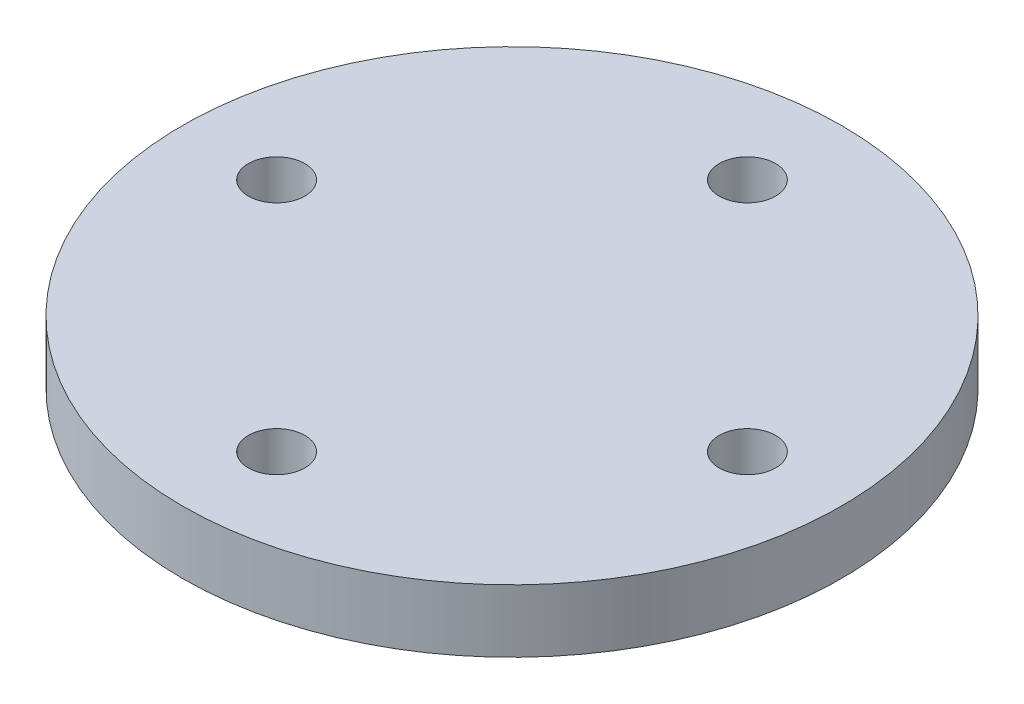
ISO-10303-21;
HEADER;
FILE_DESCRIPTION(('STEP AP214'),'2;1');
FILE_NAME('part.step','',(''),(''),'','','');
FILE_SCHEMA(('AUTOMOTIVE_DESIGN { 1 0 10303 214 1 1 1 1 }'));
ENDSEC;
DATA;
#1=APPLICATION_CONTEXT('core data for automotive mechanical design processes');
#2=APPLICATION_PROTOCOL_DEFINITION('international standard','automotive_design',2000,#1);
#3=PRODUCT_CONTEXT('',#1,'mechanical');
#4=PRODUCT('Part','Part','',(#3));
#5=PRODUCT_RELATED_PRODUCT_CATEGORY('part','',(#4));
#6=PRODUCT_DEFINITION_FORMATION('','',#4);
#7=PRODUCT_DEFINITION_CONTEXT('part definition',#1,'design');
#8=PRODUCT_DEFINITION('design','',#6,#7);
#9=PRODUCT_DEFINITION_SHAPE('','',#8);
#10=(LENGTH_UNIT() NAMED_UNIT(*) SI_UNIT(.MILLI.,.METRE.));
#11=(NAMED_UNIT(*) PLANE_ANGLE_UNIT() SI_UNIT($,.RADIAN.));
#12=(NAMED_UNIT(*) SI_UNIT($,.STERADIAN.) SOLID_ANGLE_UNIT());
#13=UNCERTAINTY_MEASURE_WITH_UNIT(LENGTH_MEASURE(1.E-05),#10,'distance_accuracy_value','');
#14=(GEOMETRIC_REPRESENTATION_CONTEXT(3) GLOBAL_UNCERTAINTY_ASSIGNED_CONTEXT((#13)) GLOBAL_UNIT_ASSIGNED_CONTEXT((#10,
#11,#12)) REPRESENTATION_CONTEXT('',''));
#15=CARTESIAN_POINT('',(0.,0.,0.));
#16=DIRECTION('',(0.,0.,1.));
#17=DIRECTION('',(1.,0.,0.));
#18=AXIS2_PLACEMENT_3D('',#15,#16,#17);
#19=CARTESIAN_POINT('',(0.,2.,0.));
#20=DIRECTION('',(0.,1.,0.));
#21=DIRECTION('',(0.,0.,1.));
#22=AXIS2_PLACEMENT_3D('',#19,#20,#21);
#23=PLANE('',#22);
#24=CARTESIAN_POINT('',(-7.49999999995994,2.,-3.46673283120276E-05));
#25=DIRECTION('',(0.,1.,0.));
#26=DIRECTION('',(0.,0.,1.));
#27=AXIS2_PLACEMENT_3D('',#24,#25,#26);
#28=CIRCLE('',#27,0.899999999999999);
#29=CARTESIAN_POINT('',(-7.49999999995994,2.,0.899965332671687));
#30=VERTEX_POINT('',#29);
#31=EDGE_CURVE('E63',#30,#30,#28,.T.);
#32=ORIENTED_EDGE('',*,*,#31,.F.);
#33=EDGE_LOOP('',(#32));
#34=FACE_BOUND('',#33,.T.);
#35=CARTESIAN_POINT('',(0.,2.,7.5));
#36=DIRECTION('',(0.,1.,0.));
#37=DIRECTION('',(0.,0.,1.));
#38=AXIS2_PLACEMENT_3D('',#35,#36,#37);
#39=CIRCLE('',#38,0.9);
#40=CARTESIAN_POINT('',(0.,2.,8.4));
#41=VERTEX_POINT('',#40);
#42=EDGE_CURVE('E52',#41,#41,#39,.T.);
#43=ORIENTED_EDGE('',*,*,#42,.F.);
#44=EDGE_LOOP('',(#43));
#45=FACE_BOUND('',#44,.T.);
#46=CARTESIAN_POINT('',(0.,2.,0.));
#47=DIRECTION('',(0.,1.,0.));
#48=DIRECTION('',(0.,0.,1.));
#49=AXIS2_PLACEMENT_3D('',#46,#47,#48);
#50=CIRCLE('',#49,10.5);
#51=CARTESIAN_POINT('',(0.,2.,10.5));
#52=VERTEX_POINT('',#51);
#53=EDGE_CURVE('E10',#52,#52,#50,.T.);
#54=ORIENTED_EDGE('',*,*,#53,.T.);
#55=EDGE_LOOP('',(#54));
#56=FACE_BOUND('',#55,.T.);
#57=CARTESIAN_POINT('',(0.,2.,-7.5));
#58=DIRECTION('',(0.,1.,0.));
#59=DIRECTION('',(0.,0.,-1.));
#60=AXIS2_PLACEMENT_3D('',#57,#58,#59);
#61=CIRCLE('',#60,0.9);
#62=CARTESIAN_POINT('',(0.,2.,-8.4));
#63=VERTEX_POINT('',#62);
#64=EDGE_CURVE('E57',#63,#63,#61,.T.);
#65=ORIENTED_EDGE('',*,*,#64,.F.);
#66=EDGE_LOOP('',(#65));
#67=FACE_BOUND('',#66,.T.);
#68=CARTESIAN_POINT('',(7.5,2.,0.));
#69=DIRECTION('',(0.,1.,0.));
#70=DIRECTION('',(0.,0.,-1.));
#71=AXIS2_PLACEMENT_3D('',#68,#69,#70);
#72=CIRCLE('',#71,0.9);
#73=CARTESIAN_POINT('',(7.5,2.,-0.899999999999974));
#74=VERTEX_POINT('',#73);
#75=EDGE_CURVE('E69',#74,#74,#72,.T.);
#76=ORIENTED_EDGE('',*,*,#75,.F.);
#77=EDGE_LOOP('',(#76));
#78=FACE_BOUND('',#77,.T.);
#79=ADVANCED_FACE('F41',(#34,#45,#56,#67,#78),#23,.T.);
#80=CARTESIAN_POINT('',(0.,0.,0.));
#81=DIRECTION('',(0.,1.,0.));
#82=DIRECTION('',(0.,0.,1.));
#83=AXIS2_PLACEMENT_3D('',#80,#81,#82);
#84=PLANE('',#83);
#85=CARTESIAN_POINT('',(0.,0.,0.));
#86=DIRECTION('',(0.,1.,0.));
#87=DIRECTION('',(0.,0.,1.));
#88=AXIS2_PLACEMENT_3D('',#85,#86,#87);
#89=CIRCLE('',#88,10.5);
#90=CARTESIAN_POINT('',(0.,0.,10.5));
#91=VERTEX_POINT('',#90);
#92=EDGE_CURVE('E45',#91,#91,#89,.T.);
#93=ORIENTED_EDGE('',*,*,#92,.F.);
#94=EDGE_LOOP('',(#93));
#95=FACE_BOUND('',#94,.T.);
#96=CARTESIAN_POINT('',(0.,0.,7.5));
#97=DIRECTION('',(0.,1.,0.));
#98=DIRECTION('',(0.,0.,1.));
#99=AXIS2_PLACEMENT_3D('',#96,#97,#98);
#100=CIRCLE('',#99,0.9);
#101=CARTESIAN_POINT('',(0.,0.,8.4));
#102=VERTEX_POINT('',#101);
#103=EDGE_CURVE('E54',#102,#102,#100,.T.);
#104=ORIENTED_EDGE('',*,*,#103,.T.);
#105=EDGE_LOOP('',(#104));
#106=FACE_BOUND('',#105,.T.);
#107=CARTESIAN_POINT('',(0.,0.,-7.5));
#108=DIRECTION('',(0.,1.,0.));
#109=DIRECTION('',(0.,0.,-1.));
#110=AXIS2_PLACEMENT_3D('',#107,#108,#109);
#111=CIRCLE('',#110,0.9);
#112=CARTESIAN_POINT('',(0.,0.,-8.4));
#113=VERTEX_POINT('',#112);
#114=EDGE_CURVE('E60',#113,#113,#111,.T.);
#115=ORIENTED_EDGE('',*,*,#114,.T.);
#116=EDGE_LOOP('',(#115));
#117=FACE_BOUND('',#116,.T.);
#118=CARTESIAN_POINT('',(-7.49999999995994,0.,-3.46673283120276E-05));
#119=DIRECTION('',(0.,1.,0.));
#120=DIRECTION('',(0.,0.,1.));
#121=AXIS2_PLACEMENT_3D('',#118,#119,#120);
#122=CIRCLE('',#121,0.899999999999999);
#123=CARTESIAN_POINT('',(-7.49999999995994,0.,0.899965332671687));
#124=VERTEX_POINT('',#123);
#125=EDGE_CURVE('E66',#124,#124,#122,.T.);
#126=ORIENTED_EDGE('',*,*,#125,.T.);
#127=EDGE_LOOP('',(#126));
#128=FACE_BOUND('',#127,.T.);
#129=CARTESIAN_POINT('',(7.5,0.,0.));
#130=DIRECTION('',(0.,1.,0.));
#131=DIRECTION('',(0.,0.,-1.));
#132=AXIS2_PLACEMENT_3D('',#129,#130,#131);
#133=CIRCLE('',#132,0.9);
#134=CARTESIAN_POINT('',(7.5,0.,-0.899999999999974));
#135=VERTEX_POINT('',#134);
#136=EDGE_CURVE('E72',#135,#135,#133,.T.);
#137=ORIENTED_EDGE('',*,*,#136,.T.);
#138=EDGE_LOOP('',(#137));
#139=FACE_BOUND('',#138,.T.);
#140=ADVANCED_FACE('F82',(#95,#106,#117,#128,#139),#84,.F.);
#141=CARTESIAN_POINT('',(0.,2.,0.));
#142=DIRECTION('',(0.,-1.,0.));
#143=DIRECTION('',(0.,0.,-1.));
#144=AXIS2_PLACEMENT_3D('',#141,#142,#143);
#145=CYLINDRICAL_SURFACE('',#144,10.5);
#146=ORIENTED_EDGE('',*,*,#53,.F.);
#147=EDGE_LOOP('',(#146));
#148=FACE_BOUND('',#147,.T.);
#149=ORIENTED_EDGE('',*,*,#92,.T.);
#150=EDGE_LOOP('',(#149));
#151=FACE_BOUND('',#150,.T.);
#152=ADVANCED_FACE('F43',(#148,#151),#145,.T.);
#153=CARTESIAN_POINT('',(0.,2.,7.5));
#154=DIRECTION('',(0.,-1.,0.));
#155=DIRECTION('',(0.,0.,-1.));
#156=AXIS2_PLACEMENT_3D('',#153,#154,#155);
#157=CYLINDRICAL_SURFACE('',#156,0.9);
#158=ORIENTED_EDGE('',*,*,#42,.T.);
#159=EDGE_LOOP('',(#158));
#160=FACE_BOUND('',#159,.T.);
#161=ORIENTED_EDGE('',*,*,#103,.F.);
#162=EDGE_LOOP('',(#161));
#163=FACE_BOUND('',#162,.T.);
#164=ADVANCED_FACE('F92',(#160,#163),#157,.F.);
#165=CARTESIAN_POINT('',(0.,2.,-7.5));
#166=DIRECTION('',(0.,-1.,0.));
#167=DIRECTION('',(0.,0.,-1.));
#168=AXIS2_PLACEMENT_3D('',#165,#166,#167);
#169=CYLINDRICAL_SURFACE('',#168,0.9);
#170=ORIENTED_EDGE('',*,*,#64,.T.);
#171=EDGE_LOOP('',(#170));
#172=FACE_BOUND('',#171,.T.);
#173=ORIENTED_EDGE('',*,*,#114,.F.);
#174=EDGE_LOOP('',(#173));
#175=FACE_BOUND('',#174,.T.);
#176=ADVANCED_FACE('F95',(#172,#175),#169,.F.);
#177=CARTESIAN_POINT('',(-7.49999999995994,2.,-3.46673283120276E-05));
#178=DIRECTION('',(0.,-1.,0.));
#179=DIRECTION('',(0.,0.,-1.));
#180=AXIS2_PLACEMENT_3D('',#177,#178,#179);
#181=CYLINDRICAL_SURFACE('',#180,0.899999999999999);
#182=ORIENTED_EDGE('',*,*,#31,.T.);
#183=EDGE_LOOP('',(#182));
#184=FACE_BOUND('',#183,.T.);
#185=ORIENTED_EDGE('',*,*,#125,.F.);
#186=EDGE_LOOP('',(#185));
#187=FACE_BOUND('',#186,.T.);
#188=ADVANCED_FACE('F99',(#184,#187),#181,.F.);
#189=CARTESIAN_POINT('',(7.5,2.,0.));
#190=DIRECTION('',(0.,-1.,0.));
#191=DIRECTION('',(0.,0.,-1.));
#192=AXIS2_PLACEMENT_3D('',#189,#190,#191);
#193=CYLINDRICAL_SURFACE('',#192,0.9);
#194=ORIENTED_EDGE('',*,*,#75,.T.);
#195=EDGE_LOOP('',(#194));
#196=FACE_BOUND('',#195,.T.);
#197=ORIENTED_EDGE('',*,*,#136,.F.);
#198=EDGE_LOOP('',(#197));
#199=FACE_BOUND('',#198,.T.);
#200=ADVANCED_FACE('F78',(#196,#199),#193,.F.);
#201=CLOSED_SHELL('',(#79,#140,#152,#164,#176,#188,#200));
#202=MANIFOLD_SOLID_BREP('B2',#201);
#203=ADVANCED_BREP_SHAPE_REPRESENTATION('',(#18,#202),#14);
#204=SHAPE_DEFINITION_REPRESENTATION(#9,#203);
ENDSEC;
END-ISO-10303-21;
